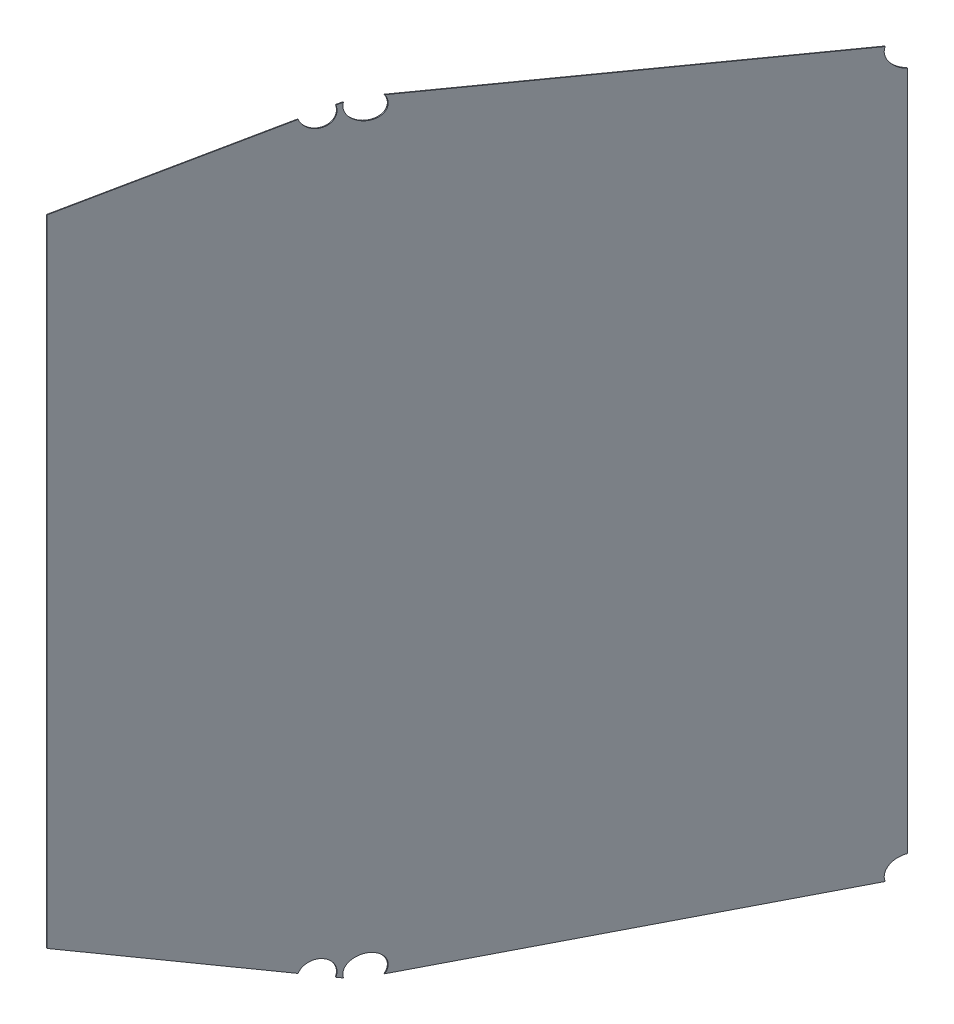
ISO-10303-21;
HEADER;
FILE_DESCRIPTION(('STEP AP214'),'2;1');
FILE_NAME('part.step','',(''),(''),'','','');
FILE_SCHEMA(('AUTOMOTIVE_DESIGN { 1 0 10303 214 1 1 1 1 }'));
ENDSEC;
DATA;
#1=APPLICATION_CONTEXT('core data for automotive mechanical design processes');
#2=APPLICATION_PROTOCOL_DEFINITION('international standard','automotive_design',2000,#1);
#3=PRODUCT_CONTEXT('',#1,'mechanical');
#4=PRODUCT('Part','Part','',(#3));
#5=PRODUCT_RELATED_PRODUCT_CATEGORY('part','',(#4));
#6=PRODUCT_DEFINITION_FORMATION('','',#4);
#7=PRODUCT_DEFINITION_CONTEXT('part definition',#1,'design');
#8=PRODUCT_DEFINITION('design','',#6,#7);
#9=PRODUCT_DEFINITION_SHAPE('','',#8);
#10=(LENGTH_UNIT() NAMED_UNIT(*) SI_UNIT(.MILLI.,.METRE.));
#11=(NAMED_UNIT(*) PLANE_ANGLE_UNIT() SI_UNIT($,.RADIAN.));
#12=(NAMED_UNIT(*) SI_UNIT($,.STERADIAN.) SOLID_ANGLE_UNIT());
#13=UNCERTAINTY_MEASURE_WITH_UNIT(LENGTH_MEASURE(1.E-05),#10,'distance_accuracy_value','');
#14=(GEOMETRIC_REPRESENTATION_CONTEXT(3) GLOBAL_UNCERTAINTY_ASSIGNED_CONTEXT((#13)) GLOBAL_UNIT_ASSIGNED_CONTEXT((#10,
#11,#12)) REPRESENTATION_CONTEXT('',''));
#15=CARTESIAN_POINT('',(0.,0.,0.));
#16=DIRECTION('',(0.,0.,1.));
#17=DIRECTION('',(1.,0.,0.));
#18=AXIS2_PLACEMENT_3D('',#15,#16,#17);
#19=CARTESIAN_POINT('',(297.627887551756,-346.121290027363,296.962439256937));
#20=DIRECTION('',(-0.142851044700198,-0.961526085177984,0.234651159277689));
#21=DIRECTION('',(0.,-0.237082631619164,-0.971489488252205));
#22=AXIS2_PLACEMENT_3D('',#19,#20,#21);
#23=PLANE('',#22);
#24=DIRECTION('',(-0.499993384276965,0.274713646407129,0.821303249815174));
#25=VECTOR('',#24,1.);
#26=CARTESIAN_POINT('',(297.085491904179,-346.121290027363,296.632239375821));
#27=LINE('',#26,#25);
#28=CARTESIAN_POINT('',(295.055296985631,-345.00583077024,299.967094869505));
#29=VERTEX_POINT('',#28);
#30=CARTESIAN_POINT('',(206.435241805539,-296.314909512294,445.536899604944));
#31=VERTEX_POINT('',#30);
#32=EDGE_CURVE('E151',#29,#31,#27,.T.);
#33=ORIENTED_EDGE('',*,*,#32,.F.);
#34=CARTESIAN_POINT('',(302.004069082359,-348.680600709539,289.139329057124));
#35=DIRECTION('',(-0.142851044700198,-0.961526085177984,0.234651159277689));
#36=DIRECTION('',(-0.953565841320189,0.0701910856819254,-0.292891443641005));
#37=AXIS2_PLACEMENT_3D('',#34,#35,#36);
#38=ELLIPSE('',#37,49.9186004740371,12.8905);
#39=CARTESIAN_POINT('',(295.675664326708,-345.048671113556,300.169216245427));
#40=VERTEX_POINT('',#39);
#41=EDGE_CURVE('E50',#29,#40,#38,.F.);
#42=ORIENTED_EDGE('',*,*,#41,.T.);
#43=DIRECTION('',(-0.499993384276965,0.274713646407129,0.821303249815174));
#44=VECTOR('',#43,1.);
#45=CARTESIAN_POINT('',(297.627887551756,-346.121290027363,296.962439256937));
#46=LINE('',#45,#44);
#47=CARTESIAN_POINT('',(206.977637453116,-296.314909512294,445.867099486061));
#48=VERTEX_POINT('',#47);
#49=EDGE_CURVE('E245',#40,#48,#46,.T.);
#50=ORIENTED_EDGE('',*,*,#49,.T.);
#51=DIRECTION('',(-0.854166374137573,0.,-0.519999812781381));
#52=VECTOR('',#51,1.);
#53=CARTESIAN_POINT('',(206.977637453116,-296.314909512294,445.867099486061));
#54=LINE('',#53,#52);
#55=EDGE_CURVE('E164',#48,#31,#54,.T.);
#56=ORIENTED_EDGE('',*,*,#55,.T.);
#57=EDGE_LOOP('',(#33,#42,#50,#56));
#58=FACE_BOUND('',#57,.T.);
#59=ADVANCED_FACE('F36',(#58),#23,.T.);
#60=CARTESIAN_POINT('',(297.627887551756,346.121290027363,296.962439256937));
#61=DIRECTION('',(0.142851044700198,-0.961526085177984,-0.234651159277689));
#62=DIRECTION('',(0.,0.237082631619164,-0.971489488252205));
#63=AXIS2_PLACEMENT_3D('',#60,#61,#62);
#64=PLANE('',#63);
#65=DIRECTION('',(-0.499993384276965,-0.274713646407129,0.821303249815174));
#66=VECTOR('',#65,1.);
#67=CARTESIAN_POINT('',(297.085491904179,346.121290027363,296.63223937582));
#68=LINE('',#67,#66);
#69=CARTESIAN_POINT('',(310.929480629491,353.727655917682,273.89171262476));
#70=VERTEX_POINT('',#69);
#71=CARTESIAN_POINT('',(308.356975602864,352.314232743518,278.117382013547));
#72=VERTEX_POINT('',#71);
#73=EDGE_CURVE('E250',#70,#72,#68,.T.);
#74=ORIENTED_EDGE('',*,*,#73,.T.);
#75=CARTESIAN_POINT('',(302.004069082359,348.680600709539,289.139329057124));
#76=DIRECTION('',(0.142851044700198,-0.961526085177984,-0.234651159277689));
#77=DIRECTION('',(-0.953565841320189,-0.0701910856819254,-0.292891443641005));
#78=AXIS2_PLACEMENT_3D('',#75,#76,#77);
#79=ELLIPSE('',#78,49.9186004740371,12.8905);
#80=CARTESIAN_POINT('',(308.977297718532,352.357048238431,278.319577678003));
#81=VERTEX_POINT('',#80);
#82=EDGE_CURVE('E219',#72,#81,#79,.T.);
#83=ORIENTED_EDGE('',*,*,#82,.T.);
#84=DIRECTION('',(-0.499993384276965,-0.274713646407129,0.821303249815174));
#85=VECTOR('',#84,1.);
#86=CARTESIAN_POINT('',(297.627887551756,346.121290027363,296.962439256937));
#87=LINE('',#86,#85);
#88=CARTESIAN_POINT('',(311.728077716689,353.868421843604,273.801068787571));
#89=VERTEX_POINT('',#88);
#90=EDGE_CURVE('E239',#89,#81,#87,.T.);
#91=ORIENTED_EDGE('',*,*,#90,.F.);
#92=CARTESIAN_POINT('',(291.243160233538,353.713997919117,261.963031251143));
#93=DIRECTION('',(0.142851044700198,-0.961526085177984,-0.234651159277689));
#94=DIRECTION('',(-0.989720643123852,-0.137139305521998,-0.0405691934286767));
#95=AXIS2_PLACEMENT_3D('',#92,#93,#94);
#96=ELLIPSE('',#95,43.4426567316473,12.8905);
#97=EDGE_CURVE('E225',#89,#70,#96,.T.);
#98=ORIENTED_EDGE('',*,*,#97,.T.);
#99=EDGE_LOOP('',(#74,#83,#91,#98));
#100=FACE_BOUND('',#99,.T.);
#101=ADVANCED_FACE('F273',(#100),#64,.F.);
#102=CARTESIAN_POINT('',(295.675664326708,345.048671113556,300.169216245427));
#103=VERTEX_POINT('',#102);
#104=CARTESIAN_POINT('',(206.977637453116,296.314909512294,445.867099486061));
#105=VERTEX_POINT('',#104);
#106=EDGE_CURVE('E163',#103,#105,#87,.T.);
#107=ORIENTED_EDGE('',*,*,#106,.F.);
#108=CARTESIAN_POINT('',(295.055296985631,345.00583077024,299.967094869505));
#109=VERTEX_POINT('',#108);
#110=EDGE_CURVE('E216',#103,#109,#79,.T.);
#111=ORIENTED_EDGE('',*,*,#110,.T.);
#112=CARTESIAN_POINT('',(206.435241805539,296.314909512294,445.536899604944));
#113=VERTEX_POINT('',#112);
#114=EDGE_CURVE('E238',#109,#113,#68,.T.);
#115=ORIENTED_EDGE('',*,*,#114,.T.);
#116=DIRECTION('',(-0.854166374137573,0.,-0.519999812781381));
#117=VECTOR('',#116,1.);
#118=CARTESIAN_POINT('',(206.977637453116,296.314909512294,445.867099486061));
#119=LINE('',#118,#117);
#120=EDGE_CURVE('E167',#105,#113,#119,.T.);
#121=ORIENTED_EDGE('',*,*,#120,.F.);
#122=EDGE_LOOP('',(#107,#111,#115,#121));
#123=FACE_BOUND('',#122,.T.);
#124=ADVANCED_FACE('F38',(#123),#64,.F.);
#125=CARTESIAN_POINT('',(206.977637453116,0.,445.867099486061));
#126=DIRECTION('',(0.519999812781381,0.,-0.854166374137573));
#127=DIRECTION('',(-0.854166374137573,0.,-0.519999812781381));
#128=AXIS2_PLACEMENT_3D('',#125,#126,#127);
#129=PLANE('',#128);
#130=DIRECTION('',(0.,-1.,0.));
#131=VECTOR('',#130,1.);
#132=CARTESIAN_POINT('',(206.435241805539,0.,445.536899604944));
#133=LINE('',#132,#131);
#134=EDGE_CURVE('E155',#113,#31,#133,.T.);
#135=ORIENTED_EDGE('',*,*,#134,.T.);
#136=ORIENTED_EDGE('',*,*,#55,.F.);
#137=DIRECTION('',(0.,-1.,0.));
#138=VECTOR('',#137,1.);
#139=CARTESIAN_POINT('',(206.977637453116,0.,445.867099486061));
#140=LINE('',#139,#138);
#141=EDGE_CURVE('E242',#105,#48,#140,.T.);
#142=ORIENTED_EDGE('',*,*,#141,.F.);
#143=ORIENTED_EDGE('',*,*,#120,.T.);
#144=EDGE_LOOP('',(#135,#136,#142,#143));
#145=FACE_BOUND('',#144,.T.);
#146=ADVANCED_FACE('F264',(#145),#129,.F.);
#147=CARTESIAN_POINT('',(311.728077716689,-353.868421843605,273.801068787571));
#148=VERTEX_POINT('',#147);
#149=CARTESIAN_POINT('',(308.977297718532,-352.357048238431,278.319577678003));
#150=VERTEX_POINT('',#149);
#151=EDGE_CURVE('E146',#148,#150,#46,.T.);
#152=ORIENTED_EDGE('',*,*,#151,.T.);
#153=CARTESIAN_POINT('',(308.356975602864,-352.314232743518,278.117382013547));
#154=VERTEX_POINT('',#153);
#155=EDGE_CURVE('E135',#150,#154,#38,.F.);
#156=ORIENTED_EDGE('',*,*,#155,.T.);
#157=CARTESIAN_POINT('',(310.929480629491,-353.727655917682,273.89171262476));
#158=VERTEX_POINT('',#157);
#159=EDGE_CURVE('E144',#158,#154,#27,.T.);
#160=ORIENTED_EDGE('',*,*,#159,.F.);
#161=CARTESIAN_POINT('',(291.243160233538,-353.713997919117,261.963031251143));
#162=DIRECTION('',(-0.142851044700198,-0.961526085177984,0.234651159277689));
#163=DIRECTION('',(-0.989720643123852,0.137139305521998,-0.0405691934286767));
#164=AXIS2_PLACEMENT_3D('',#161,#162,#163);
#165=ELLIPSE('',#164,43.4426567316473,12.8905);
#166=EDGE_CURVE('E58',#158,#148,#165,.F.);
#167=ORIENTED_EDGE('',*,*,#166,.T.);
#168=EDGE_LOOP('',(#152,#156,#160,#167));
#169=FACE_BOUND('',#168,.T.);
#170=ADVANCED_FACE('F143',(#169),#23,.T.);
#171=CARTESIAN_POINT('',(358.639575737006,-351.881493409303,196.74291764123));
#172=DIRECTION('',(0.0272146874480635,-0.998629534754574,-0.044703613981055));
#173=DIRECTION('',(0.,0.0447201778072238,-0.998999552400746));
#174=AXIS2_PLACEMENT_3D('',#171,#172,#173);
#175=PLANE('',#174);
#176=DIRECTION('',(-0.519287171110336,-0.0523359562429403,0.852995768808006));
#177=VECTOR('',#176,1.);
#178=CARTESIAN_POINT('',(358.639575737006,-351.881493409303,196.74291764123));
#179=LINE('',#178,#177);
#180=CARTESIAN_POINT('',(502.97182645726,-337.335079058282,-40.34131246534));
#181=VERTEX_POINT('',#180);
#182=CARTESIAN_POINT('',(326.243532135801,-355.146503628469,249.957573529727));
#183=VERTEX_POINT('',#182);
#184=EDGE_CURVE('E191',#181,#183,#179,.T.);
#185=ORIENTED_EDGE('',*,*,#184,.T.);
#186=CARTESIAN_POINT('',(268.337150331449,-357.29406274601,262.679405831595));
#187=DIRECTION('',(0.0272146874480635,-0.998629534754574,-0.044703613981055));
#188=DIRECTION('',(-0.998905379930991,-0.0288697614839897,0.0368046032009488));
#189=AXIS2_PLACEMENT_3D('',#186,#187,#188);
#190=ELLIPSE('',#189,102.404921043513,12.8905);
#191=CARTESIAN_POINT('',(325.521855396881,-355.164572334714,249.921865831069));
#192=VERTEX_POINT('',#191);
#193=EDGE_CURVE('E183',#183,#192,#190,.F.);
#194=ORIENTED_EDGE('',*,*,#193,.T.);
#195=DIRECTION('',(-0.519287171110336,-0.0523359562429403,0.852995768808006));
#196=VECTOR('',#195,1.);
#197=CARTESIAN_POINT('',(358.097180089429,-351.881493409303,196.412717760114));
#198=LINE('',#197,#196);
#199=CARTESIAN_POINT('',(502.188995600585,-337.359311135026,-40.2765666835502));
#200=VERTEX_POINT('',#199);
#201=EDGE_CURVE('E150',#200,#192,#198,.T.);
#202=ORIENTED_EDGE('',*,*,#201,.F.);
#203=CARTESIAN_POINT('',(490.070631516643,-337.137621183772,-52.6062996675774));
#204=DIRECTION('',(0.0272146874480635,-0.998629534754574,-0.044703613981055));
#205=DIRECTION('',(-0.99953734174407,-0.0277925532543197,0.012356230930321));
#206=AXIS2_PLACEMENT_3D('',#203,#204,#205);
#207=ELLIPSE('',#206,48.3852502541207,12.8905);
#208=EDGE_CURVE('E201',#200,#181,#207,.F.);
#209=ORIENTED_EDGE('',*,*,#208,.T.);
#210=EDGE_LOOP('',(#185,#194,#202,#209));
#211=FACE_BOUND('',#210,.T.);
#212=ADVANCED_FACE('F188',(#211),#175,.T.);
#213=CARTESIAN_POINT('',(510.761528079999,0.,-53.1368962851096));
#214=DIRECTION('',(-0.519999812781381,0.,0.854166374137573));
#215=DIRECTION('',(0.854166374137573,0.,0.519999812781381));
#216=AXIS2_PLACEMENT_3D('',#213,#214,#215);
#217=PLANE('',#216);
#218=CARTESIAN_POINT('',(511.63310106481,-330.533842631242,-52.6062996675774));
#219=DIRECTION('',(-0.519999812781381,0.,0.854166374137573));
#220=DIRECTION('',(-0.804044903435811,-0.33751211354612,-0.489486839933955));
#221=AXIS2_PLACEMENT_3D('',#218,#219,#220);
#222=ELLIPSE('',#221,25.9259631508701,12.8905);
#223=CARTESIAN_POINT('',(510.219132432422,-317.515484633386,-53.4670961662258));
#224=VERTEX_POINT('',#223);
#225=CARTESIAN_POINT('',(510.761528079999,-317.330702545691,-53.1368962851096));
#226=VERTEX_POINT('',#225);
#227=EDGE_CURVE('E199',#224,#226,#222,.F.);
#228=ORIENTED_EDGE('',*,*,#227,.F.);
#229=DIRECTION('',(0.,1.,0.));
#230=VECTOR('',#229,1.);
#231=CARTESIAN_POINT('',(510.219132432422,0.,-53.4670961662258));
#232=LINE('',#231,#230);
#233=CARTESIAN_POINT('',(510.219132432422,317.515484633386,-53.4670961662258));
#234=VERTEX_POINT('',#233);
#235=EDGE_CURVE('E153',#224,#234,#232,.T.);
#236=ORIENTED_EDGE('',*,*,#235,.T.);
#237=CARTESIAN_POINT('',(511.63310106481,330.533842631242,-52.6062996675774));
#238=DIRECTION('',(-0.519999812781381,0.,0.854166374137573));
#239=DIRECTION('',(-0.804044903435811,0.33751211354612,-0.489486839933955));
#240=AXIS2_PLACEMENT_3D('',#237,#238,#239);
#241=ELLIPSE('',#240,25.9259631508701,12.8905);
#242=CARTESIAN_POINT('',(510.761528079999,317.330702545691,-53.1368962851096));
#243=VERTEX_POINT('',#242);
#244=EDGE_CURVE('E233',#234,#243,#241,.T.);
#245=ORIENTED_EDGE('',*,*,#244,.T.);
#246=DIRECTION('',(0.,1.,0.));
#247=VECTOR('',#246,1.);
#248=CARTESIAN_POINT('',(510.761528079999,0.,-53.1368962851096));
#249=LINE('',#248,#247);
#250=EDGE_CURVE('E207',#226,#243,#249,.T.);
#251=ORIENTED_EDGE('',*,*,#250,.F.);
#252=EDGE_LOOP('',(#228,#236,#245,#251));
#253=FACE_BOUND('',#252,.T.);
#254=ADVANCED_FACE('F204',(#253),#217,.F.);
#255=CARTESIAN_POINT('',(358.639575737006,351.881493409303,196.74291764123));
#256=DIRECTION('',(-0.0272146874480635,-0.998629534754574,0.044703613981055));
#257=DIRECTION('',(0.,-0.0447201778072238,-0.998999552400746));
#258=AXIS2_PLACEMENT_3D('',#255,#256,#257);
#259=PLANE('',#258);
#260=DIRECTION('',(-0.519287171110336,0.0523359562429403,0.852995768808006));
#261=VECTOR('',#260,1.);
#262=CARTESIAN_POINT('',(358.097180089429,351.881493409303,196.412717760114));
#263=LINE('',#262,#261);
#264=CARTESIAN_POINT('',(502.188995600585,337.359311135026,-40.27656668355));
#265=VERTEX_POINT('',#264);
#266=CARTESIAN_POINT('',(325.521855396881,355.164572334714,249.921865831069));
#267=VERTEX_POINT('',#266);
#268=EDGE_CURVE('E160',#265,#267,#263,.T.);
#269=ORIENTED_EDGE('',*,*,#268,.T.);
#270=CARTESIAN_POINT('',(268.337150331449,357.29406274601,262.679405831595));
#271=DIRECTION('',(-0.0272146874480635,-0.998629534754574,0.044703613981055));
#272=DIRECTION('',(-0.998905379930991,0.0288697614839897,0.0368046032009488));
#273=AXIS2_PLACEMENT_3D('',#270,#271,#272);
#274=ELLIPSE('',#273,102.404921043513,12.8905);
#275=CARTESIAN_POINT('',(326.243532135801,355.146503628469,249.957573529727));
#276=VERTEX_POINT('',#275);
#277=EDGE_CURVE('E222',#267,#276,#274,.T.);
#278=ORIENTED_EDGE('',*,*,#277,.T.);
#279=DIRECTION('',(-0.519287171110336,0.0523359562429403,0.852995768808006));
#280=VECTOR('',#279,1.);
#281=CARTESIAN_POINT('',(358.639575737006,351.881493409303,196.74291764123));
#282=LINE('',#281,#280);
#283=CARTESIAN_POINT('',(502.97182645726,337.335079058282,-40.34131246534));
#284=VERTEX_POINT('',#283);
#285=EDGE_CURVE('E168',#284,#276,#282,.T.);
#286=ORIENTED_EDGE('',*,*,#285,.F.);
#287=CARTESIAN_POINT('',(490.070631516643,337.137621183772,-52.6062996675774));
#288=DIRECTION('',(-0.0272146874480635,-0.998629534754574,0.044703613981055));
#289=DIRECTION('',(-0.99953734174407,0.0277925532543197,0.012356230930321));
#290=AXIS2_PLACEMENT_3D('',#287,#288,#289);
#291=ELLIPSE('',#290,48.3852502541207,12.8905);
#292=EDGE_CURVE('E230',#284,#265,#291,.T.);
#293=ORIENTED_EDGE('',*,*,#292,.T.);
#294=EDGE_LOOP('',(#269,#278,#286,#293));
#295=FACE_BOUND('',#294,.T.);
#296=ADVANCED_FACE('F277',(#295),#259,.F.);
#297=CARTESIAN_POINT('',(349.050088816568,0.,212.494879606097));
#298=DIRECTION('',(0.854166374137573,0.,0.519999812781381));
#299=DIRECTION('',(0.519999812781381,0.,-0.854166374137573));
#300=AXIS2_PLACEMENT_3D('',#297,#298,#299);
#301=PLANE('',#300);
#302=ORIENTED_EDGE('',*,*,#49,.F.);
#303=CARTESIAN_POINT('',(302.342611998333,-348.616827558469,289.217899765568));
#304=DIRECTION('',(0.854166374137573,0.,0.519999812781381));
#305=DIRECTION('',(-0.448750535725368,-0.505234477758224,0.737130299994899));
#306=AXIS2_PLACEMENT_3D('',#303,#304,#305);
#307=ELLIPSE('',#306,13.8011477967056,12.8905);
#308=EDGE_CURVE('E192',#40,#150,#307,.F.);
#309=ORIENTED_EDGE('',*,*,#308,.T.);
#310=ORIENTED_EDGE('',*,*,#151,.F.);
#311=CARTESIAN_POINT('',(319.472307634822,-349.301960286353,261.080178073634));
#312=DIRECTION('',(0.854166374137573,0.,0.519999812781381));
#313=DIRECTION('',(-0.499970563472394,-0.274867206132338,0.821265763717263));
#314=AXIS2_PLACEMENT_3D('',#311,#312,#313);
#315=ELLIPSE('',#314,15.5784261762808,12.8905);
#316=EDGE_CURVE('E208',#148,#183,#315,.F.);
#317=ORIENTED_EDGE('',*,*,#316,.T.);
#318=ORIENTED_EDGE('',*,*,#184,.F.);
#319=CARTESIAN_POINT('',(510.438511218023,-330.899700855026,-52.6062996675774));
#320=DIRECTION('',(0.854166374137573,0.,0.519999812781381));
#321=DIRECTION('',(-0.448062327049526,-0.507488327748628,0.735999828993095));
#322=AXIS2_PLACEMENT_3D('',#319,#320,#321);
#323=ELLIPSE('',#322,15.7832202166015,12.8905);
#324=EDGE_CURVE('E210',#181,#226,#323,.F.);
#325=ORIENTED_EDGE('',*,*,#324,.T.);
#326=ORIENTED_EDGE('',*,*,#250,.T.);
#327=CARTESIAN_POINT('',(510.438511218023,330.899700855026,-52.6062996675774));
#328=DIRECTION('',(0.854166374137573,0.,0.519999812781381));
#329=DIRECTION('',(-0.448062327049526,0.507488327748628,0.735999828993095));
#330=AXIS2_PLACEMENT_3D('',#327,#328,#329);
#331=ELLIPSE('',#330,15.7832202166015,12.8905);
#332=EDGE_CURVE('E235',#284,#243,#331,.T.);
#333=ORIENTED_EDGE('',*,*,#332,.F.);
#334=ORIENTED_EDGE('',*,*,#285,.T.);
#335=CARTESIAN_POINT('',(319.472307634822,349.301960286353,261.080178073634));
#336=DIRECTION('',(0.854166374137573,0.,0.519999812781381));
#337=DIRECTION('',(-0.499970563472394,0.274867206132338,0.821265763717263));
#338=AXIS2_PLACEMENT_3D('',#335,#336,#337);
#339=ELLIPSE('',#338,15.5784261762808,12.8905);
#340=EDGE_CURVE('E228',#89,#276,#339,.T.);
#341=ORIENTED_EDGE('',*,*,#340,.F.);
#342=ORIENTED_EDGE('',*,*,#90,.T.);
#343=CARTESIAN_POINT('',(302.342611998333,348.616827558469,289.217899765568));
#344=DIRECTION('',(0.854166374137573,0.,0.519999812781381));
#345=DIRECTION('',(-0.448750535725367,0.505234477758224,0.737130299994899));
#346=AXIS2_PLACEMENT_3D('',#343,#344,#345);
#347=ELLIPSE('',#346,13.8011477967056,12.8905);
#348=EDGE_CURVE('E220',#103,#81,#347,.T.);
#349=ORIENTED_EDGE('',*,*,#348,.F.);
#350=ORIENTED_EDGE('',*,*,#106,.T.);
#351=ORIENTED_EDGE('',*,*,#141,.T.);
#352=EDGE_LOOP('',(#302,#309,#310,#317,#318,#325,#326,#333,#334,#341,#342,#349,#350,#351));
#353=FACE_BOUND('',#352,.T.);
#354=ADVANCED_FACE('F267',(#353),#301,.T.);
#355=CARTESIAN_POINT('',(348.507693168991,0.,212.164679724981));
#356=DIRECTION('',(0.854166374137573,0.,0.519999812781381));
#357=DIRECTION('',(0.519999812781381,0.,-0.854166374137573));
#358=AXIS2_PLACEMENT_3D('',#355,#356,#357);
#359=PLANE('',#358);
#360=CARTESIAN_POINT('',(301.691230064145,-348.739531879054,289.066723835953));
#361=DIRECTION('',(0.854166374137573,0.,0.519999812781381));
#362=DIRECTION('',(-0.448750535725368,-0.505234477758224,0.737130299994899));
#363=AXIS2_PLACEMENT_3D('',#360,#361,#362);
#364=ELLIPSE('',#363,13.8011477967056,12.8905);
#365=EDGE_CURVE('E11',#29,#154,#364,.F.);
#366=ORIENTED_EDGE('',*,*,#365,.F.);
#367=ORIENTED_EDGE('',*,*,#32,.T.);
#368=ORIENTED_EDGE('',*,*,#134,.F.);
#369=ORIENTED_EDGE('',*,*,#114,.F.);
#370=CARTESIAN_POINT('',(301.691230064145,348.739531879054,289.066723835953));
#371=DIRECTION('',(0.854166374137573,0.,0.519999812781381));
#372=DIRECTION('',(-0.448750535725367,0.505234477758224,0.737130299994899));
#373=AXIS2_PLACEMENT_3D('',#370,#371,#372);
#374=ELLIPSE('',#373,13.8011477967056,12.8905);
#375=EDGE_CURVE('E177',#109,#72,#374,.T.);
#376=ORIENTED_EDGE('',*,*,#375,.T.);
#377=ORIENTED_EDGE('',*,*,#73,.F.);
#378=CARTESIAN_POINT('',(318.714463916806,349.420406478018,261.103879275976));
#379=DIRECTION('',(0.854166374137573,0.,0.519999812781381));
#380=DIRECTION('',(-0.499970563472394,0.274867206132338,0.821265763717263));
#381=AXIS2_PLACEMENT_3D('',#378,#379,#380);
#382=ELLIPSE('',#381,15.5784261762808,12.8905);
#383=EDGE_CURVE('E174',#70,#267,#382,.T.);
#384=ORIENTED_EDGE('',*,*,#383,.T.);
#385=ORIENTED_EDGE('',*,*,#268,.F.);
#386=CARTESIAN_POINT('',(509.695096329277,331.127381051256,-52.6062996675774));
#387=DIRECTION('',(0.854166374137573,0.,0.519999812781381));
#388=DIRECTION('',(-0.448062327049526,0.507488327748628,0.735999828993095));
#389=AXIS2_PLACEMENT_3D('',#386,#387,#388);
#390=ELLIPSE('',#389,15.7832202166015,12.8905);
#391=EDGE_CURVE('E171',#265,#234,#390,.T.);
#392=ORIENTED_EDGE('',*,*,#391,.T.);
#393=ORIENTED_EDGE('',*,*,#235,.F.);
#394=CARTESIAN_POINT('',(509.695096329277,-331.127381051256,-52.6062996675774));
#395=DIRECTION('',(0.854166374137573,0.,0.519999812781381));
#396=DIRECTION('',(-0.448062327049526,-0.507488327748628,0.735999828993095));
#397=AXIS2_PLACEMENT_3D('',#394,#395,#396);
#398=ELLIPSE('',#397,15.7832202166015,12.8905);
#399=EDGE_CURVE('E180',#200,#224,#398,.F.);
#400=ORIENTED_EDGE('',*,*,#399,.F.);
#401=ORIENTED_EDGE('',*,*,#201,.T.);
#402=CARTESIAN_POINT('',(318.714463916806,-349.420406478018,261.103879275976));
#403=DIRECTION('',(0.854166374137573,0.,0.519999812781381));
#404=DIRECTION('',(-0.499970563472394,-0.274867206132338,0.821265763717263));
#405=AXIS2_PLACEMENT_3D('',#402,#403,#404);
#406=ELLIPSE('',#405,15.5784261762808,12.8905);
#407=EDGE_CURVE('E44',#158,#192,#406,.F.);
#408=ORIENTED_EDGE('',*,*,#407,.F.);
#409=ORIENTED_EDGE('',*,*,#159,.T.);
#410=EDGE_LOOP('',(#366,#367,#368,#369,#376,#377,#384,#385,#392,#393,#400,#401,#408,#409));
#411=FACE_BOUND('',#410,.T.);
#412=ADVANCED_FACE('F148',(#411),#359,.F.);
#413=CARTESIAN_POINT('',(527.404446490594,325.703668961447,-52.6062996675774));
#414=DIRECTION('',(-0.956162432915219,0.292836817838277,0.));
#415=DIRECTION('',(-0.292836817838277,-0.95616243291522,0.));
#416=AXIS2_PLACEMENT_3D('',#413,#414,#415);
#417=CYLINDRICAL_SURFACE('',#416,12.8905);
#418=ORIENTED_EDGE('',*,*,#332,.T.);
#419=ORIENTED_EDGE('',*,*,#244,.F.);
#420=ORIENTED_EDGE('',*,*,#391,.F.);
#421=ORIENTED_EDGE('',*,*,#292,.F.);
#422=EDGE_LOOP('',(#418,#419,#420,#421));
#423=FACE_BOUND('',#422,.T.);
#424=ADVANCED_FACE('F281',(#423),#417,.F.);
#425=CARTESIAN_POINT('',(348.035492490059,344.837714707076,260.186878033403));
#426=DIRECTION('',(-0.987534125825098,0.154345353221032,0.0308846607547164));
#427=DIRECTION('',(-0.154419018029273,-0.988005448806268,0.));
#428=AXIS2_PLACEMENT_3D('',#425,#426,#427);
#429=CYLINDRICAL_SURFACE('',#428,12.8905);
#430=ORIENTED_EDGE('',*,*,#340,.T.);
#431=ORIENTED_EDGE('',*,*,#277,.F.);
#432=ORIENTED_EDGE('',*,*,#383,.F.);
#433=ORIENTED_EDGE('',*,*,#97,.F.);
#434=EDGE_LOOP('',(#430,#431,#432,#433));
#435=FACE_BOUND('',#434,.T.);
#436=ADVANCED_FACE('F312',(#435),#429,.F.);
#437=CARTESIAN_POINT('',(343.551648260765,340.854059616739,298.781895999598));
#438=DIRECTION('',(-0.958112575764111,0.180484822317733,-0.22236348862976));
#439=DIRECTION('',(-0.226076163467082,0.,0.974109628487474));
#440=AXIS2_PLACEMENT_3D('',#437,#438,#439);
#441=CYLINDRICAL_SURFACE('',#440,12.8905);
#442=ORIENTED_EDGE('',*,*,#348,.T.);
#443=ORIENTED_EDGE('',*,*,#82,.F.);
#444=ORIENTED_EDGE('',*,*,#375,.F.);
#445=ORIENTED_EDGE('',*,*,#110,.F.);
#446=EDGE_LOOP('',(#442,#443,#444,#445));
#447=FACE_BOUND('',#446,.T.);
#448=ADVANCED_FACE('F272',(#447),#441,.F.);
#449=CARTESIAN_POINT('',(527.404446490594,-325.703668961447,-52.6062996675774));
#450=DIRECTION('',(-0.956162432915219,-0.292836817838277,0.));
#451=DIRECTION('',(0.292836817838277,-0.95616243291522,0.));
#452=AXIS2_PLACEMENT_3D('',#449,#450,#451);
#453=CYLINDRICAL_SURFACE('',#452,12.8905);
#454=ORIENTED_EDGE('',*,*,#208,.F.);
#455=ORIENTED_EDGE('',*,*,#399,.T.);
#456=ORIENTED_EDGE('',*,*,#227,.T.);
#457=ORIENTED_EDGE('',*,*,#324,.F.);
#458=EDGE_LOOP('',(#454,#455,#456,#457));
#459=FACE_BOUND('',#458,.T.);
#460=ADVANCED_FACE('F198',(#459),#453,.F.);
#461=CARTESIAN_POINT('',(348.035492490059,-344.837714707076,260.186878033403));
#462=DIRECTION('',(-0.987534125825098,-0.154345353221032,0.0308846607547164));
#463=DIRECTION('',(0.154419018029273,-0.988005448806268,0.));
#464=AXIS2_PLACEMENT_3D('',#461,#462,#463);
#465=CYLINDRICAL_SURFACE('',#464,12.8905);
#466=ORIENTED_EDGE('',*,*,#166,.F.);
#467=ORIENTED_EDGE('',*,*,#407,.T.);
#468=ORIENTED_EDGE('',*,*,#193,.F.);
#469=ORIENTED_EDGE('',*,*,#316,.F.);
#470=EDGE_LOOP('',(#466,#467,#468,#469));
#471=FACE_BOUND('',#470,.T.);
#472=ADVANCED_FACE('F182',(#471),#465,.F.);
#473=CARTESIAN_POINT('',(343.551648260765,-340.854059616739,298.781895999598));
#474=DIRECTION('',(-0.958112575764111,-0.180484822317733,-0.22236348862976));
#475=DIRECTION('',(-0.226076163467082,0.,0.974109628487474));
#476=AXIS2_PLACEMENT_3D('',#473,#474,#475);
#477=CYLINDRICAL_SURFACE('',#476,12.8905);
#478=ORIENTED_EDGE('',*,*,#41,.F.);
#479=ORIENTED_EDGE('',*,*,#365,.T.);
#480=ORIENTED_EDGE('',*,*,#155,.F.);
#481=ORIENTED_EDGE('',*,*,#308,.F.);
#482=EDGE_LOOP('',(#478,#479,#480,#481));
#483=FACE_BOUND('',#482,.T.);
#484=ADVANCED_FACE('F134',(#483),#477,.F.);
#485=CLOSED_SHELL('',(#59,#101,#124,#146,#170,#212,#254,#296,#354,#412,#424,#436,#448,#460,#472,#484));
#486=MANIFOLD_SOLID_BREP('B2',#485);
#487=ADVANCED_BREP_SHAPE_REPRESENTATION('',(#18,#486),#14);
#488=SHAPE_DEFINITION_REPRESENTATION(#9,#487);
ENDSEC;
END-ISO-10303-21;
